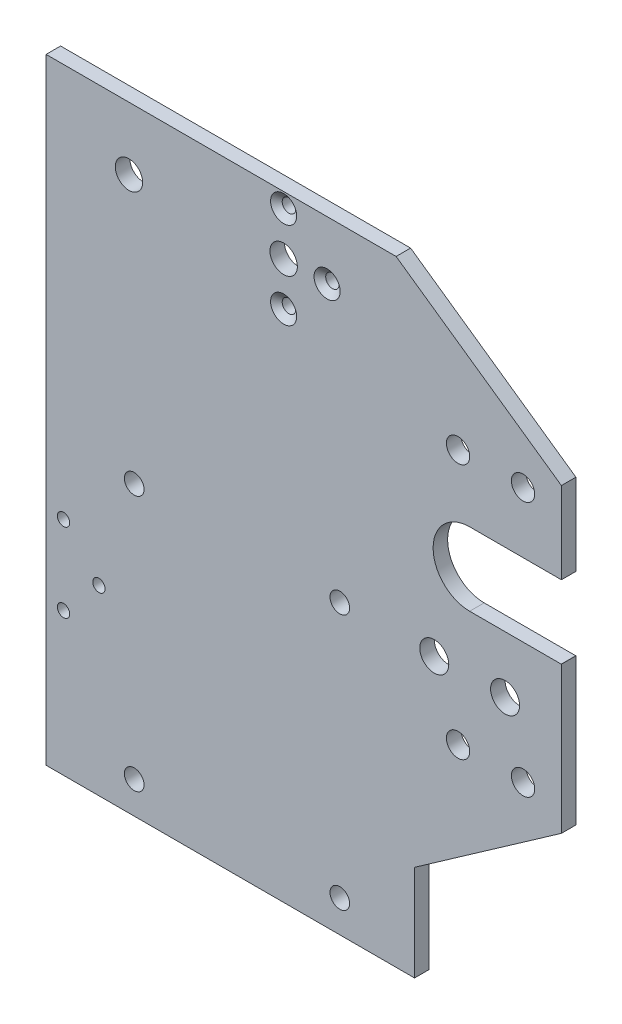
ISO-10303-21;
HEADER;
FILE_DESCRIPTION(('STEP AP214'),'2;1');
FILE_NAME('part.step','',(''),(''),'','','');
FILE_SCHEMA(('AUTOMOTIVE_DESIGN { 1 0 10303 214 1 1 1 1 }'));
ENDSEC;
DATA;
#1=APPLICATION_CONTEXT('core data for automotive mechanical design processes');
#2=APPLICATION_PROTOCOL_DEFINITION('international standard','automotive_design',2000,#1);
#3=PRODUCT_CONTEXT('',#1,'mechanical');
#4=PRODUCT('Part','Part','',(#3));
#5=PRODUCT_RELATED_PRODUCT_CATEGORY('part','',(#4));
#6=PRODUCT_DEFINITION_FORMATION('','',#4);
#7=PRODUCT_DEFINITION_CONTEXT('part definition',#1,'design');
#8=PRODUCT_DEFINITION('design','',#6,#7);
#9=PRODUCT_DEFINITION_SHAPE('','',#8);
#10=(LENGTH_UNIT() NAMED_UNIT(*) SI_UNIT(.MILLI.,.METRE.));
#11=(NAMED_UNIT(*) PLANE_ANGLE_UNIT() SI_UNIT($,.RADIAN.));
#12=(NAMED_UNIT(*) SI_UNIT($,.STERADIAN.) SOLID_ANGLE_UNIT());
#13=UNCERTAINTY_MEASURE_WITH_UNIT(LENGTH_MEASURE(1.E-05),#10,'distance_accuracy_value','');
#14=(GEOMETRIC_REPRESENTATION_CONTEXT(3) GLOBAL_UNCERTAINTY_ASSIGNED_CONTEXT((#13)) GLOBAL_UNIT_ASSIGNED_CONTEXT((#10,
#11,#12)) REPRESENTATION_CONTEXT('',''));
#15=CARTESIAN_POINT('',(0.,0.,0.));
#16=DIRECTION('',(0.,0.,1.));
#17=DIRECTION('',(1.,0.,0.));
#18=AXIS2_PLACEMENT_3D('',#15,#16,#17);
#19=CARTESIAN_POINT('',(80.144,-35.,14.975));
#20=DIRECTION('',(1.,0.,0.));
#21=DIRECTION('',(0.,0.,-1.));
#22=AXIS2_PLACEMENT_3D('',#19,#20,#21);
#23=PLANE('',#22);
#24=DIRECTION('',(0.,1.,0.));
#25=VECTOR('',#24,1.);
#26=CARTESIAN_POINT('',(80.144,-35.,11.8));
#27=LINE('',#26,#25);
#28=CARTESIAN_POINT('',(80.144,8.4872878022684,11.8));
#29=VERTEX_POINT('',#28);
#30=CARTESIAN_POINT('',(80.144,40.5508002353234,11.8));
#31=VERTEX_POINT('',#30);
#32=EDGE_CURVE('E237',#29,#31,#27,.T.);
#33=ORIENTED_EDGE('',*,*,#32,.T.);
#34=DIRECTION('',(0.,0.,-1.));
#35=VECTOR('',#34,1.);
#36=CARTESIAN_POINT('',(80.144,40.5508002353234,11.8));
#37=LINE('',#36,#35);
#38=CARTESIAN_POINT('',(80.144,40.5508002353234,14.975));
#39=VERTEX_POINT('',#38);
#40=EDGE_CURVE('E192',#31,#39,#37,.F.);
#41=ORIENTED_EDGE('',*,*,#40,.T.);
#42=DIRECTION('',(0.,1.,0.));
#43=VECTOR('',#42,1.);
#44=CARTESIAN_POINT('',(80.144,-35.,14.975));
#45=LINE('',#44,#43);
#46=CARTESIAN_POINT('',(80.144,8.4872878022684,14.975));
#47=VERTEX_POINT('',#46);
#48=EDGE_CURVE('E241',#47,#39,#45,.T.);
#49=ORIENTED_EDGE('',*,*,#48,.F.);
#50=DIRECTION('',(0.,0.,-1.));
#51=VECTOR('',#50,1.);
#52=CARTESIAN_POINT('',(80.144,8.4872878022684,11.8));
#53=LINE('',#52,#51);
#54=EDGE_CURVE('E207',#47,#29,#53,.T.);
#55=ORIENTED_EDGE('',*,*,#54,.T.);
#56=EDGE_LOOP('',(#33,#41,#49,#55));
#57=FACE_BOUND('',#56,.T.);
#58=ADVANCED_FACE('F33',(#57),#23,.T.);
#59=CARTESIAN_POINT('',(80.144,56.5500397172488,14.975));
#60=VERTEX_POINT('',#59);
#61=CARTESIAN_POINT('',(80.144,74.4169725036177,14.975));
#62=VERTEX_POINT('',#61);
#63=EDGE_CURVE('E242',#60,#62,#45,.T.);
#64=ORIENTED_EDGE('',*,*,#63,.F.);
#65=DIRECTION('',(0.,0.,-1.));
#66=VECTOR('',#65,1.);
#67=CARTESIAN_POINT('',(80.144,56.5500397172488,11.8));
#68=LINE('',#67,#66);
#69=CARTESIAN_POINT('',(80.144,56.5500397172488,11.8));
#70=VERTEX_POINT('',#69);
#71=EDGE_CURVE('E186',#60,#70,#68,.T.);
#72=ORIENTED_EDGE('',*,*,#71,.T.);
#73=CARTESIAN_POINT('',(80.144,74.4169725036177,11.8));
#74=VERTEX_POINT('',#73);
#75=EDGE_CURVE('E240',#70,#74,#27,.T.);
#76=ORIENTED_EDGE('',*,*,#75,.T.);
#77=DIRECTION('',(0.,0.,-1.));
#78=VECTOR('',#77,1.);
#79=CARTESIAN_POINT('',(80.144,74.4169725036177,11.8));
#80=LINE('',#79,#78);
#81=EDGE_CURVE('E166',#62,#74,#80,.T.);
#82=ORIENTED_EDGE('',*,*,#81,.F.);
#83=EDGE_LOOP('',(#64,#72,#76,#82));
#84=FACE_BOUND('',#83,.T.);
#85=ADVANCED_FACE('F251',(#84),#23,.T.);
#86=CARTESIAN_POINT('',(0.,99.75,0.));
#87=DIRECTION('',(0.,1.,0.));
#88=DIRECTION('',(0.,0.,1.));
#89=AXIS2_PLACEMENT_3D('',#86,#87,#88);
#90=PLANE('',#89);
#91=DIRECTION('',(1.,0.,0.));
#92=VECTOR('',#91,1.);
#93=CARTESIAN_POINT('',(-32.638,99.75,14.975));
#94=LINE('',#93,#92);
#95=CARTESIAN_POINT('',(-32.638,99.75,14.975));
#96=VERTEX_POINT('',#95);
#97=CARTESIAN_POINT('',(43.9646872762982,99.75,14.975));
#98=VERTEX_POINT('',#97);
#99=EDGE_CURVE('E221',#96,#98,#94,.T.);
#100=ORIENTED_EDGE('',*,*,#99,.T.);
#101=DIRECTION('',(0.,0.,-1.));
#102=VECTOR('',#101,1.);
#103=CARTESIAN_POINT('',(43.9646872762982,99.75,11.8));
#104=LINE('',#103,#102);
#105=CARTESIAN_POINT('',(43.9646872762982,99.75,11.8));
#106=VERTEX_POINT('',#105);
#107=EDGE_CURVE('E149',#98,#106,#104,.T.);
#108=ORIENTED_EDGE('',*,*,#107,.T.);
#109=DIRECTION('',(-1.,0.,0.));
#110=VECTOR('',#109,1.);
#111=CARTESIAN_POINT('',(80.144,99.75,11.8));
#112=LINE('',#111,#110);
#113=CARTESIAN_POINT('',(-32.638,99.75,11.8));
#114=VERTEX_POINT('',#113);
#115=EDGE_CURVE('E224',#106,#114,#112,.T.);
#116=ORIENTED_EDGE('',*,*,#115,.T.);
#117=DIRECTION('',(0.,0.,1.));
#118=VECTOR('',#117,1.);
#119=CARTESIAN_POINT('',(-32.638,99.75,11.8));
#120=LINE('',#119,#118);
#121=EDGE_CURVE('E218',#114,#96,#120,.T.);
#122=ORIENTED_EDGE('',*,*,#121,.T.);
#123=EDGE_LOOP('',(#100,#108,#116,#122));
#124=FACE_BOUND('',#123,.T.);
#125=ADVANCED_FACE('F260',(#124),#90,.T.);
#126=CARTESIAN_POINT('',(80.144,-35.,11.8));
#127=DIRECTION('',(0.,0.,-1.));
#128=DIRECTION('',(-1.,0.,0.));
#129=AXIS2_PLACEMENT_3D('',#126,#127,#128);
#130=PLANE('',#129);
#131=CARTESIAN_POINT('',(-14.5061,86.034,11.8));
#132=DIRECTION('',(0.,0.,1.));
#133=DIRECTION('',(1.,0.,0.));
#134=AXIS2_PLACEMENT_3D('',#131,#132,#133);
#135=CIRCLE('',#134,2.9972);
#136=CARTESIAN_POINT('',(-11.5089,86.034,11.8));
#137=VERTEX_POINT('',#136);
#138=EDGE_CURVE('E423',#137,#137,#135,.T.);
#139=ORIENTED_EDGE('',*,*,#138,.T.);
#140=EDGE_LOOP('',(#139));
#141=FACE_BOUND('',#140,.T.);
#142=CARTESIAN_POINT('',(57.526,13.97,11.8));
#143=DIRECTION('',(0.,0.,1.));
#144=DIRECTION('',(1.,0.,0.));
#145=AXIS2_PLACEMENT_3D('',#142,#143,#144);
#146=CIRCLE('',#145,2.5527);
#147=CARTESIAN_POINT('',(60.0787,13.97,11.8));
#148=VERTEX_POINT('',#147);
#149=EDGE_CURVE('E419',#148,#148,#146,.T.);
#150=ORIENTED_EDGE('',*,*,#149,.T.);
#151=EDGE_LOOP('',(#150));
#152=FACE_BOUND('',#151,.T.);
#153=CARTESIAN_POINT('',(71.75,13.97,11.8));
#154=DIRECTION('',(0.,0.,1.));
#155=DIRECTION('',(1.,0.,0.));
#156=AXIS2_PLACEMENT_3D('',#153,#154,#155);
#157=CIRCLE('',#156,2.55269999999999);
#158=CARTESIAN_POINT('',(74.3027,13.97,11.8));
#159=VERTEX_POINT('',#158);
#160=EDGE_CURVE('E415',#159,#159,#157,.T.);
#161=ORIENTED_EDGE('',*,*,#160,.T.);
#162=EDGE_LOOP('',(#161));
#163=FACE_BOUND('',#162,.T.);
#164=CARTESIAN_POINT('',(71.75,69.85,11.8));
#165=DIRECTION('',(0.,0.,1.));
#166=DIRECTION('',(1.,0.,0.));
#167=AXIS2_PLACEMENT_3D('',#164,#165,#166);
#168=CIRCLE('',#167,2.55269999999999);
#169=CARTESIAN_POINT('',(74.3027,69.85,11.8));
#170=VERTEX_POINT('',#169);
#171=EDGE_CURVE('E411',#170,#170,#168,.T.);
#172=ORIENTED_EDGE('',*,*,#171,.T.);
#173=EDGE_LOOP('',(#172));
#174=FACE_BOUND('',#173,.T.);
#175=CARTESIAN_POINT('',(57.526,69.85,11.8));
#176=DIRECTION('',(0.,0.,1.));
#177=DIRECTION('',(1.,0.,0.));
#178=AXIS2_PLACEMENT_3D('',#175,#176,#177);
#179=CIRCLE('',#178,2.5527);
#180=CARTESIAN_POINT('',(60.0787,69.85,11.8));
#181=VERTEX_POINT('',#180);
#182=EDGE_CURVE('E407',#181,#181,#179,.T.);
#183=ORIENTED_EDGE('',*,*,#182,.T.);
#184=EDGE_LOOP('',(#183));
#185=FACE_BOUND('',#184,.T.);
#186=CARTESIAN_POINT('',(-28.824,-3.75800000000003,11.8));
#187=DIRECTION('',(0.,0.,1.));
#188=DIRECTION('',(1.,0.,0.));
#189=AXIS2_PLACEMENT_3D('',#186,#187,#188);
#190=CIRCLE('',#189,1.35255);
#191=CARTESIAN_POINT('',(-27.47145,-3.75800000000003,11.8));
#192=VERTEX_POINT('',#191);
#193=EDGE_CURVE('E403',#192,#192,#190,.T.);
#194=ORIENTED_EDGE('',*,*,#193,.T.);
#195=EDGE_LOOP('',(#194));
#196=FACE_BOUND('',#195,.T.);
#197=CARTESIAN_POINT('',(-21.077,4.87799999999997,11.8));
#198=DIRECTION('',(0.,0.,1.));
#199=DIRECTION('',(1.,0.,0.));
#200=AXIS2_PLACEMENT_3D('',#197,#198,#199);
#201=CIRCLE('',#200,1.35255);
#202=CARTESIAN_POINT('',(-19.72445,4.87799999999997,11.8));
#203=VERTEX_POINT('',#202);
#204=EDGE_CURVE('E399',#203,#203,#201,.T.);
#205=ORIENTED_EDGE('',*,*,#204,.T.);
#206=EDGE_LOOP('',(#205));
#207=FACE_BOUND('',#206,.T.);
#208=CARTESIAN_POINT('',(-28.824,13.514,11.8));
#209=DIRECTION('',(0.,0.,1.));
#210=DIRECTION('',(1.,0.,0.));
#211=AXIS2_PLACEMENT_3D('',#208,#209,#210);
#212=CIRCLE('',#211,1.35255);
#213=CARTESIAN_POINT('',(-27.47145,13.514,11.8));
#214=VERTEX_POINT('',#213);
#215=EDGE_CURVE('E395',#214,#214,#212,.T.);
#216=ORIENTED_EDGE('',*,*,#215,.T.);
#217=EDGE_LOOP('',(#216));
#218=FACE_BOUND('',#217,.T.);
#219=CARTESIAN_POINT('',(19.352,87.0000000000002,11.8));
#220=DIRECTION('',(0.,0.,-1.));
#221=DIRECTION('',(-1.,0.,0.));
#222=AXIS2_PLACEMENT_3D('',#219,#220,#221);
#223=CIRCLE('',#222,3.);
#224=CARTESIAN_POINT('',(16.352,87.0000000000002,11.8));
#225=VERTEX_POINT('',#224);
#226=EDGE_CURVE('E391',#225,#225,#223,.T.);
#227=ORIENTED_EDGE('',*,*,#226,.F.);
#228=EDGE_LOOP('',(#227));
#229=FACE_BOUND('',#228,.T.);
#230=CARTESIAN_POINT('',(19.352,96.5190714883335,11.8));
#231=DIRECTION('',(0.,0.,1.));
#232=DIRECTION('',(1.,0.,0.));
#233=AXIS2_PLACEMENT_3D('',#230,#231,#232);
#234=CIRCLE('',#233,1.4732);
#235=CARTESIAN_POINT('',(20.8252,96.5190714883335,11.8));
#236=VERTEX_POINT('',#235);
#237=EDGE_CURVE('E384',#236,#236,#234,.T.);
#238=ORIENTED_EDGE('',*,*,#237,.T.);
#239=EDGE_LOOP('',(#238));
#240=FACE_BOUND('',#239,.T.);
#241=CARTESIAN_POINT('',(28.8710714883333,87.0000000000002,11.8));
#242=DIRECTION('',(0.,0.,1.));
#243=DIRECTION('',(1.,0.,0.));
#244=AXIS2_PLACEMENT_3D('',#241,#242,#243);
#245=CIRCLE('',#244,1.4732);
#246=CARTESIAN_POINT('',(30.3442714883333,87.0000000000002,11.8));
#247=VERTEX_POINT('',#246);
#248=EDGE_CURVE('E377',#247,#247,#245,.T.);
#249=ORIENTED_EDGE('',*,*,#248,.T.);
#250=EDGE_LOOP('',(#249));
#251=FACE_BOUND('',#250,.T.);
#252=CARTESIAN_POINT('',(19.352,77.4809285116669,11.8));
#253=DIRECTION('',(0.,0.,1.));
#254=DIRECTION('',(1.,0.,0.));
#255=AXIS2_PLACEMENT_3D('',#252,#253,#254);
#256=CIRCLE('',#255,1.4732);
#257=CARTESIAN_POINT('',(20.8252,77.4809285116669,11.8));
#258=VERTEX_POINT('',#257);
#259=EDGE_CURVE('E370',#258,#258,#256,.T.);
#260=ORIENTED_EDGE('',*,*,#259,.T.);
#261=EDGE_LOOP('',(#260));
#262=FACE_BOUND('',#261,.T.);
#263=CARTESIAN_POINT('',(-13.356,28.,11.8));
#264=DIRECTION('',(0.,0.,1.));
#265=DIRECTION('',(1.,0.,0.));
#266=AXIS2_PLACEMENT_3D('',#263,#264,#265);
#267=CIRCLE('',#266,2.15);
#268=CARTESIAN_POINT('',(-11.206,28.,11.8));
#269=VERTEX_POINT('',#268);
#270=EDGE_CURVE('E366',#269,#269,#267,.T.);
#271=ORIENTED_EDGE('',*,*,#270,.T.);
#272=EDGE_LOOP('',(#271));
#273=FACE_BOUND('',#272,.T.);
#274=CARTESIAN_POINT('',(31.644,28.,11.8));
#275=DIRECTION('',(0.,0.,1.));
#276=DIRECTION('',(1.,0.,0.));
#277=AXIS2_PLACEMENT_3D('',#274,#275,#276);
#278=CIRCLE('',#277,2.15);
#279=CARTESIAN_POINT('',(33.794,28.,11.8));
#280=VERTEX_POINT('',#279);
#281=EDGE_CURVE('E362',#280,#280,#278,.T.);
#282=ORIENTED_EDGE('',*,*,#281,.T.);
#283=EDGE_LOOP('',(#282));
#284=FACE_BOUND('',#283,.T.);
#285=CARTESIAN_POINT('',(31.644,-28.,11.8));
#286=DIRECTION('',(0.,0.,1.));
#287=DIRECTION('',(1.,0.,0.));
#288=AXIS2_PLACEMENT_3D('',#285,#286,#287);
#289=CIRCLE('',#288,2.15);
#290=CARTESIAN_POINT('',(33.794,-28.,11.8));
#291=VERTEX_POINT('',#290);
#292=EDGE_CURVE('E355',#291,#291,#289,.T.);
#293=ORIENTED_EDGE('',*,*,#292,.T.);
#294=EDGE_LOOP('',(#293));
#295=FACE_BOUND('',#294,.T.);
#296=CARTESIAN_POINT('',(-13.356,-28.,11.8));
#297=DIRECTION('',(0.,0.,1.));
#298=DIRECTION('',(1.,0.,0.));
#299=AXIS2_PLACEMENT_3D('',#296,#297,#298);
#300=CIRCLE('',#299,2.15);
#301=CARTESIAN_POINT('',(-11.206,-28.,11.8));
#302=VERTEX_POINT('',#301);
#303=EDGE_CURVE('E175',#302,#302,#300,.T.);
#304=ORIENTED_EDGE('',*,*,#303,.T.);
#305=EDGE_LOOP('',(#304));
#306=FACE_BOUND('',#305,.T.);
#307=CARTESIAN_POINT('',(52.3160000000001,28.1270262176272,11.8));
#308=DIRECTION('',(0.,0.,-1.));
#309=DIRECTION('',(-1.,0.,0.));
#310=AXIS2_PLACEMENT_3D('',#307,#308,#309);
#311=CIRCLE('',#310,3.175);
#312=CARTESIAN_POINT('',(49.1410000000001,28.1270262176272,11.8));
#313=VERTEX_POINT('',#312);
#314=EDGE_CURVE('E180',#313,#313,#311,.F.);
#315=ORIENTED_EDGE('',*,*,#314,.T.);
#316=EDGE_LOOP('',(#315));
#317=FACE_BOUND('',#316,.T.);
#318=CARTESIAN_POINT('',(67.8160000000002,28.1270262176273,11.8));
#319=DIRECTION('',(0.,0.,-1.));
#320=DIRECTION('',(-1.,0.,0.));
#321=AXIS2_PLACEMENT_3D('',#318,#319,#320);
#322=CIRCLE('',#321,3.175);
#323=CARTESIAN_POINT('',(64.6410000000002,28.1270262176273,11.8));
#324=VERTEX_POINT('',#323);
#325=EDGE_CURVE('E177',#324,#324,#322,.F.);
#326=ORIENTED_EDGE('',*,*,#325,.T.);
#327=EDGE_LOOP('',(#326));
#328=FACE_BOUND('',#327,.T.);
#329=DIRECTION('',(1.,0.,0.));
#330=VECTOR('',#329,1.);
#331=CARTESIAN_POINT('',(80.144,40.5504199762861,11.8));
#332=LINE('',#331,#330);
#333=CARTESIAN_POINT('',(60.066,40.5504199762861,11.8));
#334=VERTEX_POINT('',#333);
#335=CARTESIAN_POINT('',(80.066,40.5504199762861,11.8));
#336=VERTEX_POINT('',#335);
#337=EDGE_CURVE('E137',#334,#336,#332,.T.);
#338=ORIENTED_EDGE('',*,*,#337,.T.);
#339=CARTESIAN_POINT('',(80.066,48.5504199762861,11.8));
#340=DIRECTION('',(0.,0.,-1.));
#341=DIRECTION('',(-1.,0.,0.));
#342=AXIS2_PLACEMENT_3D('',#339,#340,#341);
#343=CIRCLE('',#342,8.);
#344=EDGE_CURVE('E193',#336,#31,#343,.F.);
#345=ORIENTED_EDGE('',*,*,#344,.T.);
#346=ORIENTED_EDGE('',*,*,#32,.F.);
#347=DIRECTION('',(-0.819152044288989,-0.57357643635105,0.));
#348=VECTOR('',#347,1.);
#349=CARTESIAN_POINT('',(59.7116582771076,-5.81959189537777,11.8));
#350=LINE('',#349,#348);
#351=CARTESIAN_POINT('',(48.,-14.0201833059448,11.8));
#352=VERTEX_POINT('',#351);
#353=EDGE_CURVE('E215',#29,#352,#350,.T.);
#354=ORIENTED_EDGE('',*,*,#353,.T.);
#355=DIRECTION('',(0.,-1.,0.));
#356=VECTOR('',#355,1.);
#357=CARTESIAN_POINT('',(48.,-35.,11.8));
#358=LINE('',#357,#356);
#359=CARTESIAN_POINT('',(48.,-35.,11.8));
#360=VERTEX_POINT('',#359);
#361=EDGE_CURVE('E212',#352,#360,#358,.T.);
#362=ORIENTED_EDGE('',*,*,#361,.T.);
#363=DIRECTION('',(-1.,0.,0.));
#364=VECTOR('',#363,1.);
#365=CARTESIAN_POINT('',(80.144,-35.,11.8));
#366=LINE('',#365,#364);
#367=CARTESIAN_POINT('',(-32.638,-35.,11.8));
#368=VERTEX_POINT('',#367);
#369=EDGE_CURVE('E232',#360,#368,#366,.T.);
#370=ORIENTED_EDGE('',*,*,#369,.T.);
#371=DIRECTION('',(0.,1.,0.));
#372=VECTOR('',#371,1.);
#373=CARTESIAN_POINT('',(-32.638,-35.,11.8));
#374=LINE('',#373,#372);
#375=EDGE_CURVE('E41',#368,#114,#374,.T.);
#376=ORIENTED_EDGE('',*,*,#375,.T.);
#377=ORIENTED_EDGE('',*,*,#115,.F.);
#378=DIRECTION('',(0.819152044288993,-0.573576436351044,0.));
#379=VECTOR('',#378,1.);
#380=CARTESIAN_POINT('',(131.553160825192,38.4198905607832,11.8));
#381=LINE('',#380,#379);
#382=EDGE_CURVE('E56',#106,#74,#381,.T.);
#383=ORIENTED_EDGE('',*,*,#382,.T.);
#384=ORIENTED_EDGE('',*,*,#75,.F.);
#385=CARTESIAN_POINT('',(80.066,56.5504199762861,11.8));
#386=VERTEX_POINT('',#385);
#387=EDGE_CURVE('E189',#70,#386,#343,.F.);
#388=ORIENTED_EDGE('',*,*,#387,.T.);
#389=DIRECTION('',(-1.,0.,0.));
#390=VECTOR('',#389,1.);
#391=CARTESIAN_POINT('',(80.144,56.5504199762861,11.8));
#392=LINE('',#391,#390);
#393=CARTESIAN_POINT('',(60.066,56.5504199762861,11.8));
#394=VERTEX_POINT('',#393);
#395=EDGE_CURVE('E183',#386,#394,#392,.T.);
#396=ORIENTED_EDGE('',*,*,#395,.T.);
#397=CARTESIAN_POINT('',(60.066,48.5504199762861,11.8));
#398=DIRECTION('',(0.,0.,-1.));
#399=DIRECTION('',(-1.,0.,0.));
#400=AXIS2_PLACEMENT_3D('',#397,#398,#399);
#401=CIRCLE('',#400,8.);
#402=EDGE_CURVE('E197',#394,#334,#401,.F.);
#403=ORIENTED_EDGE('',*,*,#402,.T.);
#404=EDGE_LOOP('',(#338,#345,#346,#354,#362,#370,#376,#377,#383,#384,#388,#396,#403));
#405=FACE_BOUND('',#404,.T.);
#406=ADVANCED_FACE('F257',(#141,#152,#163,#174,#185,#196,#207,#218,#229,#240,#251,#262,#273,
#284,#295,#306,#317,#328,#405),#130,.T.);
#407=CARTESIAN_POINT('',(-32.638,-35.,14.975));
#408=DIRECTION('',(0.,0.,1.));
#409=DIRECTION('',(1.,0.,0.));
#410=AXIS2_PLACEMENT_3D('',#407,#408,#409);
#411=PLANE('',#410);
#412=CARTESIAN_POINT('',(-14.5061,86.034,14.975));
#413=DIRECTION('',(0.,0.,1.));
#414=DIRECTION('',(1.,0.,0.));
#415=AXIS2_PLACEMENT_3D('',#412,#413,#414);
#416=CIRCLE('',#415,2.9972);
#417=CARTESIAN_POINT('',(-11.5089,86.034,14.975));
#418=VERTEX_POINT('',#417);
#419=EDGE_CURVE('E294',#418,#418,#416,.T.);
#420=ORIENTED_EDGE('',*,*,#419,.F.);
#421=EDGE_LOOP('',(#420));
#422=FACE_BOUND('',#421,.T.);
#423=CARTESIAN_POINT('',(57.526,13.97,14.975));
#424=DIRECTION('',(0.,0.,1.));
#425=DIRECTION('',(1.,0.,0.));
#426=AXIS2_PLACEMENT_3D('',#423,#424,#425);
#427=CIRCLE('',#426,2.5527);
#428=CARTESIAN_POINT('',(60.0787,13.97,14.975));
#429=VERTEX_POINT('',#428);
#430=EDGE_CURVE('E298',#429,#429,#427,.T.);
#431=ORIENTED_EDGE('',*,*,#430,.F.);
#432=EDGE_LOOP('',(#431));
#433=FACE_BOUND('',#432,.T.);
#434=CARTESIAN_POINT('',(71.75,13.97,14.975));
#435=DIRECTION('',(0.,0.,1.));
#436=DIRECTION('',(1.,0.,0.));
#437=AXIS2_PLACEMENT_3D('',#434,#435,#436);
#438=CIRCLE('',#437,2.55270000000001);
#439=CARTESIAN_POINT('',(74.3027,13.97,14.975));
#440=VERTEX_POINT('',#439);
#441=EDGE_CURVE('E302',#440,#440,#438,.T.);
#442=ORIENTED_EDGE('',*,*,#441,.F.);
#443=EDGE_LOOP('',(#442));
#444=FACE_BOUND('',#443,.T.);
#445=CARTESIAN_POINT('',(71.75,69.85,14.975));
#446=DIRECTION('',(0.,0.,1.));
#447=DIRECTION('',(1.,0.,0.));
#448=AXIS2_PLACEMENT_3D('',#445,#446,#447);
#449=CIRCLE('',#448,2.55270000000001);
#450=CARTESIAN_POINT('',(74.3027,69.85,14.975));
#451=VERTEX_POINT('',#450);
#452=EDGE_CURVE('E306',#451,#451,#449,.T.);
#453=ORIENTED_EDGE('',*,*,#452,.F.);
#454=EDGE_LOOP('',(#453));
#455=FACE_BOUND('',#454,.T.);
#456=CARTESIAN_POINT('',(57.526,69.85,14.975));
#457=DIRECTION('',(0.,0.,1.));
#458=DIRECTION('',(1.,0.,0.));
#459=AXIS2_PLACEMENT_3D('',#456,#457,#458);
#460=CIRCLE('',#459,2.5527);
#461=CARTESIAN_POINT('',(60.0787,69.85,14.975));
#462=VERTEX_POINT('',#461);
#463=EDGE_CURVE('E310',#462,#462,#460,.T.);
#464=ORIENTED_EDGE('',*,*,#463,.F.);
#465=EDGE_LOOP('',(#464));
#466=FACE_BOUND('',#465,.T.);
#467=CARTESIAN_POINT('',(-28.824,-3.75800000000003,14.975));
#468=DIRECTION('',(0.,0.,1.));
#469=DIRECTION('',(1.,0.,0.));
#470=AXIS2_PLACEMENT_3D('',#467,#468,#469);
#471=CIRCLE('',#470,1.35255);
#472=CARTESIAN_POINT('',(-27.47145,-3.75800000000003,14.975));
#473=VERTEX_POINT('',#472);
#474=EDGE_CURVE('E314',#473,#473,#471,.T.);
#475=ORIENTED_EDGE('',*,*,#474,.F.);
#476=EDGE_LOOP('',(#475));
#477=FACE_BOUND('',#476,.T.);
#478=CARTESIAN_POINT('',(-21.077,4.87799999999997,14.975));
#479=DIRECTION('',(0.,0.,1.));
#480=DIRECTION('',(1.,0.,0.));
#481=AXIS2_PLACEMENT_3D('',#478,#479,#480);
#482=CIRCLE('',#481,1.35255);
#483=CARTESIAN_POINT('',(-19.72445,4.87799999999997,14.975));
#484=VERTEX_POINT('',#483);
#485=EDGE_CURVE('E318',#484,#484,#482,.T.);
#486=ORIENTED_EDGE('',*,*,#485,.F.);
#487=EDGE_LOOP('',(#486));
#488=FACE_BOUND('',#487,.T.);
#489=CARTESIAN_POINT('',(-28.824,13.514,14.975));
#490=DIRECTION('',(0.,0.,1.));
#491=DIRECTION('',(1.,0.,0.));
#492=AXIS2_PLACEMENT_3D('',#489,#490,#491);
#493=CIRCLE('',#492,1.35255);
#494=CARTESIAN_POINT('',(-27.47145,13.514,14.975));
#495=VERTEX_POINT('',#494);
#496=EDGE_CURVE('E322',#495,#495,#493,.T.);
#497=ORIENTED_EDGE('',*,*,#496,.F.);
#498=EDGE_LOOP('',(#497));
#499=FACE_BOUND('',#498,.T.);
#500=CARTESIAN_POINT('',(19.352,87.0000000000002,14.975));
#501=DIRECTION('',(0.,0.,1.));
#502=DIRECTION('',(1.,0.,0.));
#503=AXIS2_PLACEMENT_3D('',#500,#501,#502);
#504=CIRCLE('',#503,3.);
#505=CARTESIAN_POINT('',(22.352,87.0000000000002,14.975));
#506=VERTEX_POINT('',#505);
#507=EDGE_CURVE('E326',#506,#506,#504,.T.);
#508=ORIENTED_EDGE('',*,*,#507,.F.);
#509=EDGE_LOOP('',(#508));
#510=FACE_BOUND('',#509,.T.);
#511=CARTESIAN_POINT('',(19.352,96.5190714883335,14.975));
#512=DIRECTION('',(0.,0.,1.));
#513=DIRECTION('',(1.,0.,0.));
#514=AXIS2_PLACEMENT_3D('',#511,#512,#513);
#515=CIRCLE('',#514,2.8575);
#516=CARTESIAN_POINT('',(22.2095,96.5190714883335,14.975));
#517=VERTEX_POINT('',#516);
#518=EDGE_CURVE('E330',#517,#517,#515,.T.);
#519=ORIENTED_EDGE('',*,*,#518,.F.);
#520=EDGE_LOOP('',(#519));
#521=FACE_BOUND('',#520,.T.);
#522=CARTESIAN_POINT('',(28.8710714883333,87.0000000000002,14.975));
#523=DIRECTION('',(0.,0.,1.));
#524=DIRECTION('',(1.,0.,0.));
#525=AXIS2_PLACEMENT_3D('',#522,#523,#524);
#526=CIRCLE('',#525,2.8575);
#527=CARTESIAN_POINT('',(31.7285714883333,87.0000000000002,14.975));
#528=VERTEX_POINT('',#527);
#529=EDGE_CURVE('E334',#528,#528,#526,.T.);
#530=ORIENTED_EDGE('',*,*,#529,.F.);
#531=EDGE_LOOP('',(#530));
#532=FACE_BOUND('',#531,.T.);
#533=CARTESIAN_POINT('',(19.352,77.4809285116669,14.975));
#534=DIRECTION('',(0.,0.,1.));
#535=DIRECTION('',(1.,0.,0.));
#536=AXIS2_PLACEMENT_3D('',#533,#534,#535);
#537=CIRCLE('',#536,2.8575);
#538=CARTESIAN_POINT('',(22.2095,77.4809285116669,14.975));
#539=VERTEX_POINT('',#538);
#540=EDGE_CURVE('E338',#539,#539,#537,.T.);
#541=ORIENTED_EDGE('',*,*,#540,.F.);
#542=EDGE_LOOP('',(#541));
#543=FACE_BOUND('',#542,.T.);
#544=CARTESIAN_POINT('',(-13.356,28.,14.975));
#545=DIRECTION('',(0.,0.,1.));
#546=DIRECTION('',(1.,0.,0.));
#547=AXIS2_PLACEMENT_3D('',#544,#545,#546);
#548=CIRCLE('',#547,2.15);
#549=CARTESIAN_POINT('',(-11.206,28.,14.975));
#550=VERTEX_POINT('',#549);
#551=EDGE_CURVE('E342',#550,#550,#548,.T.);
#552=ORIENTED_EDGE('',*,*,#551,.F.);
#553=EDGE_LOOP('',(#552));
#554=FACE_BOUND('',#553,.T.);
#555=CARTESIAN_POINT('',(31.644,28.,14.975));
#556=DIRECTION('',(0.,0.,1.));
#557=DIRECTION('',(1.,0.,0.));
#558=AXIS2_PLACEMENT_3D('',#555,#556,#557);
#559=CIRCLE('',#558,2.15);
#560=CARTESIAN_POINT('',(33.794,28.,14.975));
#561=VERTEX_POINT('',#560);
#562=EDGE_CURVE('E346',#561,#561,#559,.T.);
#563=ORIENTED_EDGE('',*,*,#562,.F.);
#564=EDGE_LOOP('',(#563));
#565=FACE_BOUND('',#564,.T.);
#566=CARTESIAN_POINT('',(31.644,-28.,14.975));
#567=DIRECTION('',(0.,0.,1.));
#568=DIRECTION('',(1.,0.,0.));
#569=AXIS2_PLACEMENT_3D('',#566,#567,#568);
#570=CIRCLE('',#569,2.15);
#571=CARTESIAN_POINT('',(33.794,-28.,14.975));
#572=VERTEX_POINT('',#571);
#573=EDGE_CURVE('E350',#572,#572,#570,.T.);
#574=ORIENTED_EDGE('',*,*,#573,.F.);
#575=EDGE_LOOP('',(#574));
#576=FACE_BOUND('',#575,.T.);
#577=CARTESIAN_POINT('',(-13.356,-28.,14.975));
#578=DIRECTION('',(0.,0.,1.));
#579=DIRECTION('',(1.,0.,0.));
#580=AXIS2_PLACEMENT_3D('',#577,#578,#579);
#581=CIRCLE('',#580,2.15);
#582=CARTESIAN_POINT('',(-11.206,-28.,14.975));
#583=VERTEX_POINT('',#582);
#584=EDGE_CURVE('E353',#583,#583,#581,.T.);
#585=ORIENTED_EDGE('',*,*,#584,.F.);
#586=EDGE_LOOP('',(#585));
#587=FACE_BOUND('',#586,.T.);
#588=ORIENTED_EDGE('',*,*,#48,.T.);
#589=CARTESIAN_POINT('',(80.066,48.5504199762861,14.975));
#590=DIRECTION('',(0.,0.,1.));
#591=DIRECTION('',(1.,0.,0.));
#592=AXIS2_PLACEMENT_3D('',#589,#590,#591);
#593=CIRCLE('',#592,8.);
#594=CARTESIAN_POINT('',(80.066,40.5504199762861,14.975));
#595=VERTEX_POINT('',#594);
#596=EDGE_CURVE('E154',#595,#39,#593,.T.);
#597=ORIENTED_EDGE('',*,*,#596,.F.);
#598=DIRECTION('',(1.,0.,0.));
#599=VECTOR('',#598,1.);
#600=CARTESIAN_POINT('',(60.066,40.5504199762861,14.975));
#601=LINE('',#600,#599);
#602=CARTESIAN_POINT('',(60.066,40.5504199762861,14.975));
#603=VERTEX_POINT('',#602);
#604=EDGE_CURVE('E134',#603,#595,#601,.T.);
#605=ORIENTED_EDGE('',*,*,#604,.F.);
#606=CARTESIAN_POINT('',(60.066,48.5504199762861,14.975));
#607=DIRECTION('',(0.,0.,1.));
#608=DIRECTION('',(1.,0.,0.));
#609=AXIS2_PLACEMENT_3D('',#606,#607,#608);
#610=CIRCLE('',#609,8.);
#611=CARTESIAN_POINT('',(60.066,56.5504199762861,14.975));
#612=VERTEX_POINT('',#611);
#613=EDGE_CURVE('E143',#612,#603,#610,.T.);
#614=ORIENTED_EDGE('',*,*,#613,.F.);
#615=DIRECTION('',(-1.,0.,0.));
#616=VECTOR('',#615,1.);
#617=CARTESIAN_POINT('',(60.066,56.5504199762861,14.975));
#618=LINE('',#617,#616);
#619=CARTESIAN_POINT('',(80.066,56.5504199762861,14.975));
#620=VERTEX_POINT('',#619);
#621=EDGE_CURVE('E156',#620,#612,#618,.T.);
#622=ORIENTED_EDGE('',*,*,#621,.F.);
#623=CARTESIAN_POINT('',(80.066,48.5504199762861,14.975));
#624=DIRECTION('',(0.,0.,1.));
#625=DIRECTION('',(1.,0.,0.));
#626=AXIS2_PLACEMENT_3D('',#623,#624,#625);
#627=CIRCLE('',#626,8.);
#628=EDGE_CURVE('E11',#620,#60,#627,.F.);
#629=ORIENTED_EDGE('',*,*,#628,.T.);
#630=ORIENTED_EDGE('',*,*,#63,.T.);
#631=DIRECTION('',(0.819152044288993,-0.573576436351044,0.));
#632=VECTOR('',#631,1.);
#633=CARTESIAN_POINT('',(43.9646872762982,99.75,14.975));
#634=LINE('',#633,#632);
#635=EDGE_CURVE('E164',#98,#62,#634,.T.);
#636=ORIENTED_EDGE('',*,*,#635,.F.);
#637=ORIENTED_EDGE('',*,*,#99,.F.);
#638=DIRECTION('',(0.,1.,0.));
#639=VECTOR('',#638,1.);
#640=CARTESIAN_POINT('',(-32.638,-35.,14.975));
#641=LINE('',#640,#639);
#642=CARTESIAN_POINT('',(-32.638,-35.,14.975));
#643=VERTEX_POINT('',#642);
#644=EDGE_CURVE('E234',#643,#96,#641,.T.);
#645=ORIENTED_EDGE('',*,*,#644,.F.);
#646=DIRECTION('',(1.,0.,0.));
#647=VECTOR('',#646,1.);
#648=CARTESIAN_POINT('',(-32.638,-35.,14.975));
#649=LINE('',#648,#647);
#650=CARTESIAN_POINT('',(48.,-35.,14.975));
#651=VERTEX_POINT('',#650);
#652=EDGE_CURVE('E229',#643,#651,#649,.T.);
#653=ORIENTED_EDGE('',*,*,#652,.T.);
#654=DIRECTION('',(0.,-1.,0.));
#655=VECTOR('',#654,1.);
#656=CARTESIAN_POINT('',(48.,-35.,14.975));
#657=LINE('',#656,#655);
#658=CARTESIAN_POINT('',(48.,-14.0201833059448,14.975));
#659=VERTEX_POINT('',#658);
#660=EDGE_CURVE('E199',#659,#651,#657,.T.);
#661=ORIENTED_EDGE('',*,*,#660,.F.);
#662=DIRECTION('',(-0.819152044288989,-0.57357643635105,0.));
#663=VECTOR('',#662,1.);
#664=CARTESIAN_POINT('',(80.144,8.4872878022684,14.975));
#665=LINE('',#664,#663);
#666=EDGE_CURVE('E201',#47,#659,#665,.T.);
#667=ORIENTED_EDGE('',*,*,#666,.F.);
#668=EDGE_LOOP('',(#588,#597,#605,#614,#622,#629,#630,#636,#637,#645,#653,#661,#667));
#669=FACE_BOUND('',#668,.T.);
#670=CARTESIAN_POINT('',(52.3160000000001,28.1270262176272,14.975));
#671=DIRECTION('',(0.,0.,1.));
#672=DIRECTION('',(1.,0.,0.));
#673=AXIS2_PLACEMENT_3D('',#670,#671,#672);
#674=CIRCLE('',#673,3.175);
#675=CARTESIAN_POINT('',(55.4910000000001,28.1270262176272,14.975));
#676=VERTEX_POINT('',#675);
#677=EDGE_CURVE('E167',#676,#676,#674,.T.);
#678=ORIENTED_EDGE('',*,*,#677,.F.);
#679=EDGE_LOOP('',(#678));
#680=FACE_BOUND('',#679,.T.);
#681=CARTESIAN_POINT('',(67.8160000000002,28.1270262176273,14.975));
#682=DIRECTION('',(0.,0.,1.));
#683=DIRECTION('',(1.,0.,0.));
#684=AXIS2_PLACEMENT_3D('',#681,#682,#683);
#685=CIRCLE('',#684,3.175);
#686=CARTESIAN_POINT('',(70.9910000000002,28.1270262176273,14.975));
#687=VERTEX_POINT('',#686);
#688=EDGE_CURVE('E172',#687,#687,#685,.T.);
#689=ORIENTED_EDGE('',*,*,#688,.F.);
#690=EDGE_LOOP('',(#689));
#691=FACE_BOUND('',#690,.T.);
#692=ADVANCED_FACE('F152',(#422,#433,#444,#455,#466,#477,#488,#499,#510,#521,#532,#543,#554,
#565,#576,#587,#669,#680,#691),#411,.T.);
#693=CARTESIAN_POINT('',(0.,-35.,0.));
#694=DIRECTION('',(0.,1.,0.));
#695=DIRECTION('',(0.,0.,1.));
#696=AXIS2_PLACEMENT_3D('',#693,#694,#695);
#697=PLANE('',#696);
#698=DIRECTION('',(0.,0.,-1.));
#699=VECTOR('',#698,1.);
#700=CARTESIAN_POINT('',(48.,-35.,11.8));
#701=LINE('',#700,#699);
#702=EDGE_CURVE('E210',#651,#360,#701,.T.);
#703=ORIENTED_EDGE('',*,*,#702,.F.);
#704=ORIENTED_EDGE('',*,*,#652,.F.);
#705=DIRECTION('',(0.,0.,1.));
#706=VECTOR('',#705,1.);
#707=CARTESIAN_POINT('',(-32.638,-35.,11.8));
#708=LINE('',#707,#706);
#709=EDGE_CURVE('E226',#368,#643,#708,.T.);
#710=ORIENTED_EDGE('',*,*,#709,.F.);
#711=ORIENTED_EDGE('',*,*,#369,.F.);
#712=EDGE_LOOP('',(#703,#704,#710,#711));
#713=FACE_BOUND('',#712,.T.);
#714=ADVANCED_FACE('F266',(#713),#697,.F.);
#715=CARTESIAN_POINT('',(-32.638,-35.,11.8));
#716=DIRECTION('',(-1.,0.,0.));
#717=DIRECTION('',(0.,0.,1.));
#718=AXIS2_PLACEMENT_3D('',#715,#716,#717);
#719=PLANE('',#718);
#720=ORIENTED_EDGE('',*,*,#644,.T.);
#721=ORIENTED_EDGE('',*,*,#121,.F.);
#722=ORIENTED_EDGE('',*,*,#375,.F.);
#723=ORIENTED_EDGE('',*,*,#709,.T.);
#724=EDGE_LOOP('',(#720,#721,#722,#723));
#725=FACE_BOUND('',#724,.T.);
#726=ADVANCED_FACE('F35',(#725),#719,.T.);
#727=CARTESIAN_POINT('',(48.,-35.,11.8));
#728=DIRECTION('',(1.,0.,0.));
#729=DIRECTION('',(0.,0.,-1.));
#730=AXIS2_PLACEMENT_3D('',#727,#728,#729);
#731=PLANE('',#730);
#732=DIRECTION('',(0.,0.,-1.));
#733=VECTOR('',#732,1.);
#734=CARTESIAN_POINT('',(48.,-14.0201833059448,11.8));
#735=LINE('',#734,#733);
#736=EDGE_CURVE('E204',#659,#352,#735,.T.);
#737=ORIENTED_EDGE('',*,*,#736,.F.);
#738=ORIENTED_EDGE('',*,*,#660,.T.);
#739=ORIENTED_EDGE('',*,*,#702,.T.);
#740=ORIENTED_EDGE('',*,*,#361,.F.);
#741=EDGE_LOOP('',(#737,#738,#739,#740));
#742=FACE_BOUND('',#741,.T.);
#743=ADVANCED_FACE('F269',(#742),#731,.T.);
#744=CARTESIAN_POINT('',(80.144,8.4872878022684,11.8));
#745=DIRECTION('',(0.57357643635105,-0.819152044288989,0.));
#746=DIRECTION('',(0.819152044288989,0.57357643635105,0.));
#747=AXIS2_PLACEMENT_3D('',#744,#745,#746);
#748=PLANE('',#747);
#749=ORIENTED_EDGE('',*,*,#54,.F.);
#750=ORIENTED_EDGE('',*,*,#666,.T.);
#751=ORIENTED_EDGE('',*,*,#736,.T.);
#752=ORIENTED_EDGE('',*,*,#353,.F.);
#753=EDGE_LOOP('',(#749,#750,#751,#752));
#754=FACE_BOUND('',#753,.T.);
#755=ADVANCED_FACE('F274',(#754),#748,.T.);
#756=CARTESIAN_POINT('',(43.9646872762982,99.75,11.8));
#757=DIRECTION('',(0.573576436351044,0.819152044288993,0.));
#758=DIRECTION('',(-0.819152044288993,0.573576436351044,0.));
#759=AXIS2_PLACEMENT_3D('',#756,#757,#758);
#760=PLANE('',#759);
#761=ORIENTED_EDGE('',*,*,#107,.F.);
#762=ORIENTED_EDGE('',*,*,#635,.T.);
#763=ORIENTED_EDGE('',*,*,#81,.T.);
#764=ORIENTED_EDGE('',*,*,#382,.F.);
#765=EDGE_LOOP('',(#761,#762,#763,#764));
#766=FACE_BOUND('',#765,.T.);
#767=ADVANCED_FACE('F254',(#766),#760,.T.);
#768=CARTESIAN_POINT('',(67.8160000000002,28.1270262176273,11.8));
#769=DIRECTION('',(0.,0.,-1.));
#770=DIRECTION('',(-1.,0.,0.));
#771=AXIS2_PLACEMENT_3D('',#768,#769,#770);
#772=CYLINDRICAL_SURFACE('',#771,3.175);
#773=ORIENTED_EDGE('',*,*,#325,.F.);
#774=EDGE_LOOP('',(#773));
#775=FACE_BOUND('',#774,.T.);
#776=ORIENTED_EDGE('',*,*,#688,.T.);
#777=EDGE_LOOP('',(#776));
#778=FACE_BOUND('',#777,.T.);
#779=ADVANCED_FACE('F522',(#775,#778),#772,.F.);
#780=CARTESIAN_POINT('',(52.3160000000001,28.1270262176272,11.8));
#781=DIRECTION('',(0.,0.,-1.));
#782=DIRECTION('',(-1.,0.,0.));
#783=AXIS2_PLACEMENT_3D('',#780,#781,#782);
#784=CYLINDRICAL_SURFACE('',#783,3.175);
#785=ORIENTED_EDGE('',*,*,#314,.F.);
#786=EDGE_LOOP('',(#785));
#787=FACE_BOUND('',#786,.T.);
#788=ORIENTED_EDGE('',*,*,#677,.T.);
#789=EDGE_LOOP('',(#788));
#790=FACE_BOUND('',#789,.T.);
#791=ADVANCED_FACE('F523',(#787,#790),#784,.F.);
#792=CARTESIAN_POINT('',(80.066,48.5504199762861,11.8));
#793=DIRECTION('',(0.,0.,-1.));
#794=DIRECTION('',(-1.,0.,0.));
#795=AXIS2_PLACEMENT_3D('',#792,#793,#794);
#796=CYLINDRICAL_SURFACE('',#795,8.);
#797=DIRECTION('',(0.,0.,-1.));
#798=VECTOR('',#797,1.);
#799=CARTESIAN_POINT('',(80.066,40.5504199762861,11.8));
#800=LINE('',#799,#798);
#801=EDGE_CURVE('E140',#595,#336,#800,.T.);
#802=ORIENTED_EDGE('',*,*,#801,.F.);
#803=ORIENTED_EDGE('',*,*,#596,.T.);
#804=ORIENTED_EDGE('',*,*,#40,.F.);
#805=ORIENTED_EDGE('',*,*,#344,.F.);
#806=EDGE_LOOP('',(#802,#803,#804,#805));
#807=FACE_BOUND('',#806,.T.);
#808=ADVANCED_FACE('F515',(#807),#796,.F.);
#809=CARTESIAN_POINT('',(60.066,48.5504199762861,11.8));
#810=DIRECTION('',(0.,0.,-1.));
#811=DIRECTION('',(-1.,0.,0.));
#812=AXIS2_PLACEMENT_3D('',#809,#810,#811);
#813=CYLINDRICAL_SURFACE('',#812,8.);
#814=DIRECTION('',(0.,0.,-1.));
#815=VECTOR('',#814,1.);
#816=CARTESIAN_POINT('',(60.066,56.5504199762861,11.8));
#817=LINE('',#816,#815);
#818=EDGE_CURVE('E146',#612,#394,#817,.T.);
#819=ORIENTED_EDGE('',*,*,#818,.F.);
#820=ORIENTED_EDGE('',*,*,#613,.T.);
#821=DIRECTION('',(0.,0.,-1.));
#822=VECTOR('',#821,1.);
#823=CARTESIAN_POINT('',(60.066,40.5504199762861,11.8));
#824=LINE('',#823,#822);
#825=EDGE_CURVE('E129',#603,#334,#824,.T.);
#826=ORIENTED_EDGE('',*,*,#825,.T.);
#827=ORIENTED_EDGE('',*,*,#402,.F.);
#828=EDGE_LOOP('',(#819,#820,#826,#827));
#829=FACE_BOUND('',#828,.T.);
#830=ADVANCED_FACE('F144',(#829),#813,.F.);
#831=CARTESIAN_POINT('',(60.066,40.5504199762861,11.8));
#832=DIRECTION('',(0.,1.,0.));
#833=DIRECTION('',(0.,0.,1.));
#834=AXIS2_PLACEMENT_3D('',#831,#832,#833);
#835=PLANE('',#834);
#836=ORIENTED_EDGE('',*,*,#825,.F.);
#837=ORIENTED_EDGE('',*,*,#604,.T.);
#838=ORIENTED_EDGE('',*,*,#801,.T.);
#839=ORIENTED_EDGE('',*,*,#337,.F.);
#840=EDGE_LOOP('',(#836,#837,#838,#839));
#841=FACE_BOUND('',#840,.T.);
#842=ADVANCED_FACE('F131',(#841),#835,.T.);
#843=ORIENTED_EDGE('',*,*,#71,.F.);
#844=ORIENTED_EDGE('',*,*,#628,.F.);
#845=DIRECTION('',(0.,0.,-1.));
#846=VECTOR('',#845,1.);
#847=CARTESIAN_POINT('',(80.066,56.5504199762861,11.8));
#848=LINE('',#847,#846);
#849=EDGE_CURVE('E48',#620,#386,#848,.T.);
#850=ORIENTED_EDGE('',*,*,#849,.T.);
#851=ORIENTED_EDGE('',*,*,#387,.F.);
#852=EDGE_LOOP('',(#843,#844,#850,#851));
#853=FACE_BOUND('',#852,.T.);
#854=ADVANCED_FACE('F511',(#853),#796,.F.);
#855=CARTESIAN_POINT('',(60.066,56.5504199762861,11.8));
#856=DIRECTION('',(0.,-1.,0.));
#857=DIRECTION('',(0.,0.,-1.));
#858=AXIS2_PLACEMENT_3D('',#855,#856,#857);
#859=PLANE('',#858);
#860=ORIENTED_EDGE('',*,*,#849,.F.);
#861=ORIENTED_EDGE('',*,*,#621,.T.);
#862=ORIENTED_EDGE('',*,*,#818,.T.);
#863=ORIENTED_EDGE('',*,*,#395,.F.);
#864=EDGE_LOOP('',(#860,#861,#862,#863));
#865=FACE_BOUND('',#864,.T.);
#866=ADVANCED_FACE('F507',(#865),#859,.T.);
#867=CARTESIAN_POINT('',(-13.356,-28.,14.975));
#868=DIRECTION('',(0.,0.,1.));
#869=DIRECTION('',(1.,0.,0.));
#870=AXIS2_PLACEMENT_3D('',#867,#868,#869);
#871=CYLINDRICAL_SURFACE('',#870,2.15);
#872=ORIENTED_EDGE('',*,*,#303,.F.);
#873=EDGE_LOOP('',(#872));
#874=FACE_BOUND('',#873,.T.);
#875=ORIENTED_EDGE('',*,*,#584,.T.);
#876=EDGE_LOOP('',(#875));
#877=FACE_BOUND('',#876,.T.);
#878=ADVANCED_FACE('F503',(#874,#877),#871,.F.);
#879=CARTESIAN_POINT('',(31.644,-28.,14.975));
#880=DIRECTION('',(0.,0.,1.));
#881=DIRECTION('',(1.,0.,0.));
#882=AXIS2_PLACEMENT_3D('',#879,#880,#881);
#883=CYLINDRICAL_SURFACE('',#882,2.15);
#884=ORIENTED_EDGE('',*,*,#292,.F.);
#885=EDGE_LOOP('',(#884));
#886=FACE_BOUND('',#885,.T.);
#887=ORIENTED_EDGE('',*,*,#573,.T.);
#888=EDGE_LOOP('',(#887));
#889=FACE_BOUND('',#888,.T.);
#890=ADVANCED_FACE('F499',(#886,#889),#883,.F.);
#891=CARTESIAN_POINT('',(31.644,28.,14.975));
#892=DIRECTION('',(0.,0.,1.));
#893=DIRECTION('',(1.,0.,0.));
#894=AXIS2_PLACEMENT_3D('',#891,#892,#893);
#895=CYLINDRICAL_SURFACE('',#894,2.15);
#896=ORIENTED_EDGE('',*,*,#281,.F.);
#897=EDGE_LOOP('',(#896));
#898=FACE_BOUND('',#897,.T.);
#899=ORIENTED_EDGE('',*,*,#562,.T.);
#900=EDGE_LOOP('',(#899));
#901=FACE_BOUND('',#900,.T.);
#902=ADVANCED_FACE('F495',(#898,#901),#895,.F.);
#903=CARTESIAN_POINT('',(-13.356,28.,14.975));
#904=DIRECTION('',(0.,0.,1.));
#905=DIRECTION('',(1.,0.,0.));
#906=AXIS2_PLACEMENT_3D('',#903,#904,#905);
#907=CYLINDRICAL_SURFACE('',#906,2.15);
#908=ORIENTED_EDGE('',*,*,#270,.F.);
#909=EDGE_LOOP('',(#908));
#910=FACE_BOUND('',#909,.T.);
#911=ORIENTED_EDGE('',*,*,#551,.T.);
#912=EDGE_LOOP('',(#911));
#913=FACE_BOUND('',#912,.T.);
#914=ADVANCED_FACE('F491',(#910,#913),#907,.F.);
#915=CARTESIAN_POINT('',(19.352,77.4809285116669,14.975));
#916=DIRECTION('',(0.,0.,1.));
#917=DIRECTION('',(1.,0.,0.));
#918=AXIS2_PLACEMENT_3D('',#915,#916,#917);
#919=CYLINDRICAL_SURFACE('',#918,1.4732);
#920=ORIENTED_EDGE('',*,*,#259,.F.);
#921=EDGE_LOOP('',(#920));
#922=FACE_BOUND('',#921,.T.);
#923=CARTESIAN_POINT('',(19.352,77.4809285116669,13.8134343805613));
#924=DIRECTION('',(0.,0.,1.));
#925=DIRECTION('',(1.,0.,0.));
#926=AXIS2_PLACEMENT_3D('',#923,#924,#925);
#927=CIRCLE('',#926,1.4732);
#928=CARTESIAN_POINT('',(20.8252,77.4809285116669,13.8134343805613));
#929=VERTEX_POINT('',#928);
#930=EDGE_CURVE('E373',#929,#929,#927,.T.);
#931=ORIENTED_EDGE('',*,*,#930,.T.);
#932=EDGE_LOOP('',(#931));
#933=FACE_BOUND('',#932,.T.);
#934=ADVANCED_FACE('F487',(#922,#933),#919,.F.);
#935=CARTESIAN_POINT('',(19.352,77.4809285116669,14.975));
#936=DIRECTION('',(0.,0.,1.));
#937=DIRECTION('',(1.,0.,0.));
#938=AXIS2_PLACEMENT_3D('',#935,#936,#937);
#939=CONICAL_SURFACE('',#938,2.8575,0.872664625997165);
#940=ORIENTED_EDGE('',*,*,#930,.F.);
#941=EDGE_LOOP('',(#940));
#942=FACE_BOUND('',#941,.T.);
#943=ORIENTED_EDGE('',*,*,#540,.T.);
#944=EDGE_LOOP('',(#943));
#945=FACE_BOUND('',#944,.T.);
#946=ADVANCED_FACE('F483',(#942,#945),#939,.F.);
#947=CARTESIAN_POINT('',(28.8710714883333,87.0000000000002,14.975));
#948=DIRECTION('',(0.,0.,1.));
#949=DIRECTION('',(1.,0.,0.));
#950=AXIS2_PLACEMENT_3D('',#947,#948,#949);
#951=CYLINDRICAL_SURFACE('',#950,1.4732);
#952=ORIENTED_EDGE('',*,*,#248,.F.);
#953=EDGE_LOOP('',(#952));
#954=FACE_BOUND('',#953,.T.);
#955=CARTESIAN_POINT('',(28.8710714883333,87.0000000000002,13.8134343805613));
#956=DIRECTION('',(0.,0.,1.));
#957=DIRECTION('',(1.,0.,0.));
#958=AXIS2_PLACEMENT_3D('',#955,#956,#957);
#959=CIRCLE('',#958,1.4732);
#960=CARTESIAN_POINT('',(30.3442714883333,87.0000000000002,13.8134343805613));
#961=VERTEX_POINT('',#960);
#962=EDGE_CURVE('E380',#961,#961,#959,.T.);
#963=ORIENTED_EDGE('',*,*,#962,.T.);
#964=EDGE_LOOP('',(#963));
#965=FACE_BOUND('',#964,.T.);
#966=ADVANCED_FACE('F479',(#954,#965),#951,.F.);
#967=CARTESIAN_POINT('',(28.8710714883333,87.0000000000002,14.975));
#968=DIRECTION('',(0.,0.,1.));
#969=DIRECTION('',(1.,0.,0.));
#970=AXIS2_PLACEMENT_3D('',#967,#968,#969);
#971=CONICAL_SURFACE('',#970,2.8575,0.872664625997165);
#972=ORIENTED_EDGE('',*,*,#962,.F.);
#973=EDGE_LOOP('',(#972));
#974=FACE_BOUND('',#973,.T.);
#975=ORIENTED_EDGE('',*,*,#529,.T.);
#976=EDGE_LOOP('',(#975));
#977=FACE_BOUND('',#976,.T.);
#978=ADVANCED_FACE('F475',(#974,#977),#971,.F.);
#979=CARTESIAN_POINT('',(19.352,96.5190714883335,14.975));
#980=DIRECTION('',(0.,0.,1.));
#981=DIRECTION('',(1.,0.,0.));
#982=AXIS2_PLACEMENT_3D('',#979,#980,#981);
#983=CYLINDRICAL_SURFACE('',#982,1.4732);
#984=ORIENTED_EDGE('',*,*,#237,.F.);
#985=EDGE_LOOP('',(#984));
#986=FACE_BOUND('',#985,.T.);
#987=CARTESIAN_POINT('',(19.352,96.5190714883335,13.8134343805613));
#988=DIRECTION('',(0.,0.,1.));
#989=DIRECTION('',(1.,0.,0.));
#990=AXIS2_PLACEMENT_3D('',#987,#988,#989);
#991=CIRCLE('',#990,1.4732);
#992=CARTESIAN_POINT('',(20.8252,96.5190714883335,13.8134343805613));
#993=VERTEX_POINT('',#992);
#994=EDGE_CURVE('E387',#993,#993,#991,.T.);
#995=ORIENTED_EDGE('',*,*,#994,.T.);
#996=EDGE_LOOP('',(#995));
#997=FACE_BOUND('',#996,.T.);
#998=ADVANCED_FACE('F471',(#986,#997),#983,.F.);
#999=CARTESIAN_POINT('',(19.352,96.5190714883335,14.975));
#1000=DIRECTION('',(0.,0.,1.));
#1001=DIRECTION('',(1.,0.,0.));
#1002=AXIS2_PLACEMENT_3D('',#999,#1000,#1001);
#1003=CONICAL_SURFACE('',#1002,2.8575,0.872664625997165);
#1004=ORIENTED_EDGE('',*,*,#994,.F.);
#1005=EDGE_LOOP('',(#1004));
#1006=FACE_BOUND('',#1005,.T.);
#1007=ORIENTED_EDGE('',*,*,#518,.T.);
#1008=EDGE_LOOP('',(#1007));
#1009=FACE_BOUND('',#1008,.T.);
#1010=ADVANCED_FACE('F467',(#1006,#1009),#1003,.F.);
#1011=CARTESIAN_POINT('',(19.352,87.0000000000002,11.475));
#1012=DIRECTION('',(0.,0.,1.));
#1013=DIRECTION('',(1.,0.,0.));
#1014=AXIS2_PLACEMENT_3D('',#1011,#1012,#1013);
#1015=CYLINDRICAL_SURFACE('',#1014,3.);
#1016=ORIENTED_EDGE('',*,*,#226,.T.);
#1017=EDGE_LOOP('',(#1016));
#1018=FACE_BOUND('',#1017,.T.);
#1019=ORIENTED_EDGE('',*,*,#507,.T.);
#1020=EDGE_LOOP('',(#1019));
#1021=FACE_BOUND('',#1020,.T.);
#1022=ADVANCED_FACE('F463',(#1018,#1021),#1015,.F.);
#1023=CARTESIAN_POINT('',(-28.824,13.514,14.975));
#1024=DIRECTION('',(0.,0.,1.));
#1025=DIRECTION('',(1.,0.,0.));
#1026=AXIS2_PLACEMENT_3D('',#1023,#1024,#1025);
#1027=CYLINDRICAL_SURFACE('',#1026,1.35255);
#1028=ORIENTED_EDGE('',*,*,#215,.F.);
#1029=EDGE_LOOP('',(#1028));
#1030=FACE_BOUND('',#1029,.T.);
#1031=ORIENTED_EDGE('',*,*,#496,.T.);
#1032=EDGE_LOOP('',(#1031));
#1033=FACE_BOUND('',#1032,.T.);
#1034=ADVANCED_FACE('F459',(#1030,#1033),#1027,.F.);
#1035=CARTESIAN_POINT('',(-21.077,4.87799999999997,14.975));
#1036=DIRECTION('',(0.,0.,1.));
#1037=DIRECTION('',(1.,0.,0.));
#1038=AXIS2_PLACEMENT_3D('',#1035,#1036,#1037);
#1039=CYLINDRICAL_SURFACE('',#1038,1.35255);
#1040=ORIENTED_EDGE('',*,*,#204,.F.);
#1041=EDGE_LOOP('',(#1040));
#1042=FACE_BOUND('',#1041,.T.);
#1043=ORIENTED_EDGE('',*,*,#485,.T.);
#1044=EDGE_LOOP('',(#1043));
#1045=FACE_BOUND('',#1044,.T.);
#1046=ADVANCED_FACE('F455',(#1042,#1045),#1039,.F.);
#1047=CARTESIAN_POINT('',(-28.824,-3.75800000000003,14.975));
#1048=DIRECTION('',(0.,0.,1.));
#1049=DIRECTION('',(1.,0.,0.));
#1050=AXIS2_PLACEMENT_3D('',#1047,#1048,#1049);
#1051=CYLINDRICAL_SURFACE('',#1050,1.35255);
#1052=ORIENTED_EDGE('',*,*,#193,.F.);
#1053=EDGE_LOOP('',(#1052));
#1054=FACE_BOUND('',#1053,.T.);
#1055=ORIENTED_EDGE('',*,*,#474,.T.);
#1056=EDGE_LOOP('',(#1055));
#1057=FACE_BOUND('',#1056,.T.);
#1058=ADVANCED_FACE('F451',(#1054,#1057),#1051,.F.);
#1059=CARTESIAN_POINT('',(57.526,69.85,14.975));
#1060=DIRECTION('',(0.,0.,1.));
#1061=DIRECTION('',(1.,0.,0.));
#1062=AXIS2_PLACEMENT_3D('',#1059,#1060,#1061);
#1063=CYLINDRICAL_SURFACE('',#1062,2.5527);
#1064=ORIENTED_EDGE('',*,*,#182,.F.);
#1065=EDGE_LOOP('',(#1064));
#1066=FACE_BOUND('',#1065,.T.);
#1067=ORIENTED_EDGE('',*,*,#463,.T.);
#1068=EDGE_LOOP('',(#1067));
#1069=FACE_BOUND('',#1068,.T.);
#1070=ADVANCED_FACE('F447',(#1066,#1069),#1063,.F.);
#1071=CARTESIAN_POINT('',(71.75,69.85,14.975));
#1072=DIRECTION('',(0.,0.,1.));
#1073=DIRECTION('',(1.,0.,0.));
#1074=AXIS2_PLACEMENT_3D('',#1071,#1072,#1073);
#1075=CYLINDRICAL_SURFACE('',#1074,2.5527);
#1076=ORIENTED_EDGE('',*,*,#171,.F.);
#1077=EDGE_LOOP('',(#1076));
#1078=FACE_BOUND('',#1077,.T.);
#1079=ORIENTED_EDGE('',*,*,#452,.T.);
#1080=EDGE_LOOP('',(#1079));
#1081=FACE_BOUND('',#1080,.T.);
#1082=ADVANCED_FACE('F443',(#1078,#1081),#1075,.F.);
#1083=CARTESIAN_POINT('',(71.75,13.97,14.975));
#1084=DIRECTION('',(0.,0.,1.));
#1085=DIRECTION('',(1.,0.,0.));
#1086=AXIS2_PLACEMENT_3D('',#1083,#1084,#1085);
#1087=CYLINDRICAL_SURFACE('',#1086,2.5527);
#1088=ORIENTED_EDGE('',*,*,#160,.F.);
#1089=EDGE_LOOP('',(#1088));
#1090=FACE_BOUND('',#1089,.T.);
#1091=ORIENTED_EDGE('',*,*,#441,.T.);
#1092=EDGE_LOOP('',(#1091));
#1093=FACE_BOUND('',#1092,.T.);
#1094=ADVANCED_FACE('F437',(#1090,#1093),#1087,.F.);
#1095=CARTESIAN_POINT('',(57.526,13.97,14.975));
#1096=DIRECTION('',(0.,0.,1.));
#1097=DIRECTION('',(1.,0.,0.));
#1098=AXIS2_PLACEMENT_3D('',#1095,#1096,#1097);
#1099=CYLINDRICAL_SURFACE('',#1098,2.5527);
#1100=ORIENTED_EDGE('',*,*,#149,.F.);
#1101=EDGE_LOOP('',(#1100));
#1102=FACE_BOUND('',#1101,.T.);
#1103=ORIENTED_EDGE('',*,*,#430,.T.);
#1104=EDGE_LOOP('',(#1103));
#1105=FACE_BOUND('',#1104,.T.);
#1106=ADVANCED_FACE('F432',(#1102,#1105),#1099,.F.);
#1107=CARTESIAN_POINT('',(-14.5061,86.034,11.8));
#1108=DIRECTION('',(0.,0.,1.));
#1109=DIRECTION('',(1.,0.,0.));
#1110=AXIS2_PLACEMENT_3D('',#1107,#1108,#1109);
#1111=CYLINDRICAL_SURFACE('',#1110,2.9972);
#1112=ORIENTED_EDGE('',*,*,#138,.F.);
#1113=EDGE_LOOP('',(#1112));
#1114=FACE_BOUND('',#1113,.T.);
#1115=ORIENTED_EDGE('',*,*,#419,.T.);
#1116=EDGE_LOOP('',(#1115));
#1117=FACE_BOUND('',#1116,.T.);
#1118=ADVANCED_FACE('F429',(#1114,#1117),#1111,.F.);
#1119=CLOSED_SHELL('',(#58,#85,#125,#406,#692,#714,#726,#743,#755,#767,#779,#791,#808,#830,#842,
#854,#866,#878,#890,#902,#914,#934,#946,#966,#978,#998,#1010,#1022,#1034,#1046,#1058,#1070,
#1082,#1094,#1106,#1118));
#1120=MANIFOLD_SOLID_BREP('B2',#1119);
#1121=ADVANCED_BREP_SHAPE_REPRESENTATION('',(#18,#1120),#14);
#1122=SHAPE_DEFINITION_REPRESENTATION(#9,#1121);
ENDSEC;
END-ISO-10303-21;
